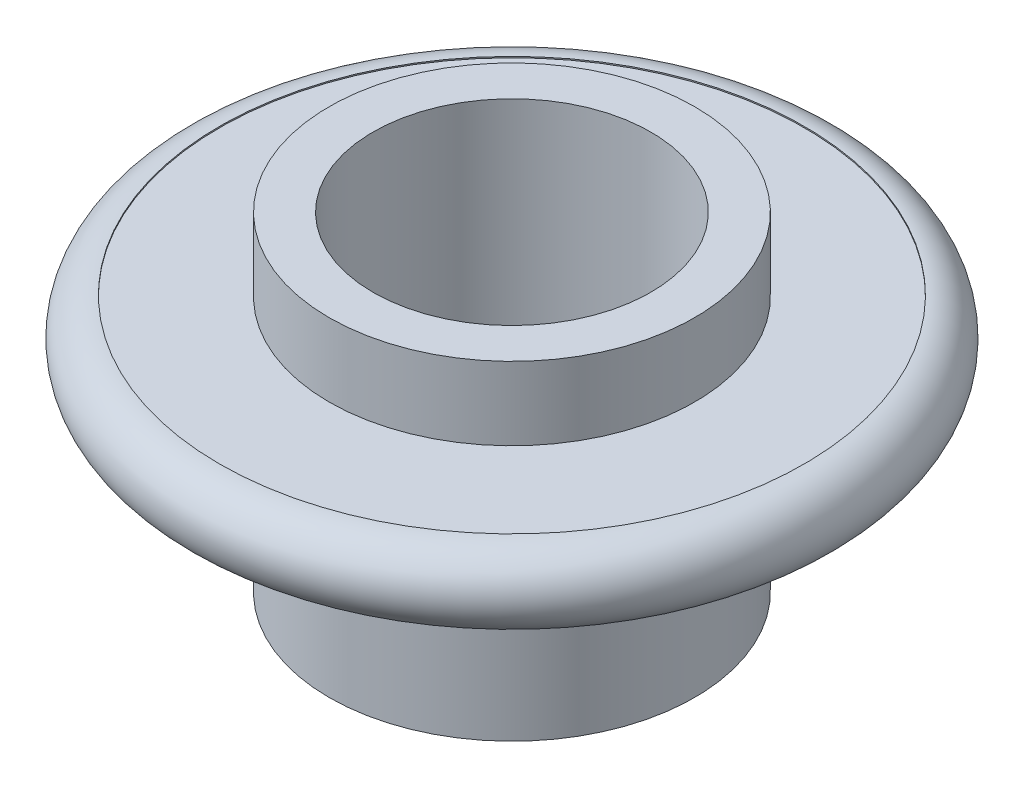
ISO-10303-21;
HEADER;
FILE_DESCRIPTION(('STEP AP214'),'2;1');
FILE_NAME('part.step','',(''),(''),'','','');
FILE_SCHEMA(('AUTOMOTIVE_DESIGN { 1 0 10303 214 1 1 1 1 }'));
ENDSEC;
DATA;
#1=APPLICATION_CONTEXT('core data for automotive mechanical design processes');
#2=APPLICATION_PROTOCOL_DEFINITION('international standard','automotive_design',2000,#1);
#3=PRODUCT_CONTEXT('',#1,'mechanical');
#4=PRODUCT('Part','Part','',(#3));
#5=PRODUCT_RELATED_PRODUCT_CATEGORY('part','',(#4));
#6=PRODUCT_DEFINITION_FORMATION('','',#4);
#7=PRODUCT_DEFINITION_CONTEXT('part definition',#1,'design');
#8=PRODUCT_DEFINITION('design','',#6,#7);
#9=PRODUCT_DEFINITION_SHAPE('','',#8);
#10=(LENGTH_UNIT() NAMED_UNIT(*) SI_UNIT(.MILLI.,.METRE.));
#11=(NAMED_UNIT(*) PLANE_ANGLE_UNIT() SI_UNIT($,.RADIAN.));
#12=(NAMED_UNIT(*) SI_UNIT($,.STERADIAN.) SOLID_ANGLE_UNIT());
#13=UNCERTAINTY_MEASURE_WITH_UNIT(LENGTH_MEASURE(1.E-05),#10,'distance_accuracy_value','');
#14=(GEOMETRIC_REPRESENTATION_CONTEXT(3) GLOBAL_UNCERTAINTY_ASSIGNED_CONTEXT((#13)) GLOBAL_UNIT_ASSIGNED_CONTEXT((#10,
#11,#12)) REPRESENTATION_CONTEXT('',''));
#15=CARTESIAN_POINT('',(0.,0.,0.));
#16=DIRECTION('',(0.,0.,1.));
#17=DIRECTION('',(1.,0.,0.));
#18=AXIS2_PLACEMENT_3D('',#15,#16,#17);
#19=CARTESIAN_POINT('',(19.,34.1894633604128,0.));
#20=DIRECTION('',(0.,-1.,0.));
#21=DIRECTION('',(0.,0.,-1.));
#22=AXIS2_PLACEMENT_3D('',#19,#20,#21);
#23=PLANE('',#22);
#24=CARTESIAN_POINT('',(0.,34.1894633604128,0.));
#25=DIRECTION('',(0.,1.,0.));
#26=DIRECTION('',(0.,0.,1.));
#27=AXIS2_PLACEMENT_3D('',#24,#25,#26);
#28=CIRCLE('',#27,19.);
#29=CARTESIAN_POINT('',(0.,34.1894633604128,19.));
#30=VERTEX_POINT('',#29);
#31=EDGE_CURVE('E10',#30,#30,#28,.T.);
#32=ORIENTED_EDGE('',*,*,#31,.F.);
#33=EDGE_LOOP('',(#32));
#34=FACE_BOUND('',#33,.T.);
#35=CARTESIAN_POINT('',(0.,34.1894633604128,0.));
#36=DIRECTION('',(0.,1.,0.));
#37=DIRECTION('',(0.,0.,1.));
#38=AXIS2_PLACEMENT_3D('',#35,#36,#37);
#39=CIRCLE('',#38,25.);
#40=CARTESIAN_POINT('',(0.,34.1894633604128,25.));
#41=VERTEX_POINT('',#40);
#42=EDGE_CURVE('E62',#41,#41,#39,.T.);
#43=ORIENTED_EDGE('',*,*,#42,.T.);
#44=EDGE_LOOP('',(#43));
#45=FACE_BOUND('',#44,.T.);
#46=ADVANCED_FACE('F31',(#34,#45),#23,.F.);
#47=CARTESIAN_POINT('',(0.,56.7977926191005,0.));
#48=DIRECTION('',(0.,1.,0.));
#49=DIRECTION('',(0.,0.,1.));
#50=AXIS2_PLACEMENT_3D('',#47,#48,#49);
#51=CYLINDRICAL_SURFACE('',#50,19.);
#52=CARTESIAN_POINT('',(0.,-10.8105366395872,0.));
#53=DIRECTION('',(0.,1.,0.));
#54=DIRECTION('',(0.,0.,1.));
#55=AXIS2_PLACEMENT_3D('',#52,#53,#54);
#56=CIRCLE('',#55,19.);
#57=CARTESIAN_POINT('',(0.,-10.8105366395872,19.));
#58=VERTEX_POINT('',#57);
#59=EDGE_CURVE('E37',#58,#58,#56,.T.);
#60=ORIENTED_EDGE('',*,*,#59,.F.);
#61=EDGE_LOOP('',(#60));
#62=FACE_BOUND('',#61,.T.);
#63=ORIENTED_EDGE('',*,*,#31,.T.);
#64=EDGE_LOOP('',(#63));
#65=FACE_BOUND('',#64,.T.);
#66=ADVANCED_FACE('F105',(#62,#65),#51,.F.);
#67=CARTESIAN_POINT('',(19.,-10.8105366395872,0.));
#68=DIRECTION('',(0.,1.,0.));
#69=DIRECTION('',(0.,0.,1.));
#70=AXIS2_PLACEMENT_3D('',#67,#68,#69);
#71=PLANE('',#70);
#72=CARTESIAN_POINT('',(0.,-10.8105366395872,0.));
#73=DIRECTION('',(0.,1.,0.));
#74=DIRECTION('',(0.,0.,1.));
#75=AXIS2_PLACEMENT_3D('',#72,#73,#74);
#76=CIRCLE('',#75,25.);
#77=CARTESIAN_POINT('',(0.,-10.8105366395872,25.));
#78=VERTEX_POINT('',#77);
#79=EDGE_CURVE('E41',#78,#78,#76,.T.);
#80=ORIENTED_EDGE('',*,*,#79,.F.);
#81=EDGE_LOOP('',(#80));
#82=FACE_BOUND('',#81,.T.);
#83=ORIENTED_EDGE('',*,*,#59,.T.);
#84=EDGE_LOOP('',(#83));
#85=FACE_BOUND('',#84,.T.);
#86=ADVANCED_FACE('F100',(#82,#85),#71,.F.);
#87=CARTESIAN_POINT('',(0.,56.7977926191005,0.));
#88=DIRECTION('',(0.,1.,0.));
#89=DIRECTION('',(0.,0.,1.));
#90=AXIS2_PLACEMENT_3D('',#87,#88,#89);
#91=CYLINDRICAL_SURFACE('',#90,25.);
#92=CARTESIAN_POINT('',(0.,14.1894633604128,0.));
#93=DIRECTION('',(0.,1.,0.));
#94=DIRECTION('',(0.,0.,1.));
#95=AXIS2_PLACEMENT_3D('',#92,#93,#94);
#96=CIRCLE('',#95,25.);
#97=CARTESIAN_POINT('',(0.,14.1894633604128,25.));
#98=VERTEX_POINT('',#97);
#99=EDGE_CURVE('E45',#98,#98,#96,.T.);
#100=ORIENTED_EDGE('',*,*,#99,.F.);
#101=EDGE_LOOP('',(#100));
#102=FACE_BOUND('',#101,.T.);
#103=ORIENTED_EDGE('',*,*,#79,.T.);
#104=EDGE_LOOP('',(#103));
#105=FACE_BOUND('',#104,.T.);
#106=ADVANCED_FACE('F94',(#102,#105),#91,.T.);
#107=CARTESIAN_POINT('',(25.,14.1894633604128,0.));
#108=DIRECTION('',(0.,1.,0.));
#109=DIRECTION('',(0.,0.,1.));
#110=AXIS2_PLACEMENT_3D('',#107,#108,#109);
#111=PLANE('',#110);
#112=CARTESIAN_POINT('',(0.,14.1894633604128,0.));
#113=DIRECTION('',(0.,1.,0.));
#114=DIRECTION('',(0.,0.,1.));
#115=AXIS2_PLACEMENT_3D('',#112,#113,#114);
#116=CIRCLE('',#115,40.);
#117=CARTESIAN_POINT('',(0.,14.1894633604128,40.));
#118=VERTEX_POINT('',#117);
#119=EDGE_CURVE('E50',#118,#118,#116,.T.);
#120=ORIENTED_EDGE('',*,*,#119,.F.);
#121=EDGE_LOOP('',(#120));
#122=FACE_BOUND('',#121,.T.);
#123=ORIENTED_EDGE('',*,*,#99,.T.);
#124=EDGE_LOOP('',(#123));
#125=FACE_BOUND('',#124,.T.);
#126=ADVANCED_FACE('F88',(#122,#125),#111,.F.);
#127=CARTESIAN_POINT('',(0.,19.2742091231247,0.));
#128=DIRECTION('',(0.,1.,0.));
#129=DIRECTION('',(0.,0.,1.));
#130=AXIS2_PLACEMENT_3D('',#127,#128,#129);
#131=TOROIDAL_SURFACE('',#130,40.,5.08474576271186);
#132=CARTESIAN_POINT('',(0.,24.3589548858365,0.));
#133=DIRECTION('',(0.,1.,0.));
#134=DIRECTION('',(0.,0.,1.));
#135=AXIS2_PLACEMENT_3D('',#132,#133,#134);
#136=CIRCLE('',#135,40.);
#137=CARTESIAN_POINT('',(0.,24.3589548858365,40.));
#138=VERTEX_POINT('',#137);
#139=EDGE_CURVE('E53',#138,#138,#136,.T.);
#140=ORIENTED_EDGE('',*,*,#139,.F.);
#141=EDGE_LOOP('',(#140));
#142=FACE_BOUND('',#141,.T.);
#143=ORIENTED_EDGE('',*,*,#119,.T.);
#144=EDGE_LOOP('',(#143));
#145=FACE_BOUND('',#144,.T.);
#146=ADVANCED_FACE('F82',(#142,#145),#131,.T.);
#147=CARTESIAN_POINT('',(0.,56.7977926191005,0.));
#148=DIRECTION('',(0.,1.,0.));
#149=DIRECTION('',(0.,0.,1.));
#150=AXIS2_PLACEMENT_3D('',#147,#148,#149);
#151=CYLINDRICAL_SURFACE('',#150,40.);
#152=CARTESIAN_POINT('',(0.,24.1894633604128,0.));
#153=DIRECTION('',(0.,1.,0.));
#154=DIRECTION('',(0.,0.,1.));
#155=AXIS2_PLACEMENT_3D('',#152,#153,#154);
#156=CIRCLE('',#155,40.);
#157=CARTESIAN_POINT('',(0.,24.1894633604128,40.));
#158=VERTEX_POINT('',#157);
#159=EDGE_CURVE('E56',#158,#158,#156,.T.);
#160=ORIENTED_EDGE('',*,*,#159,.F.);
#161=EDGE_LOOP('',(#160));
#162=FACE_BOUND('',#161,.T.);
#163=ORIENTED_EDGE('',*,*,#139,.T.);
#164=EDGE_LOOP('',(#163));
#165=FACE_BOUND('',#164,.T.);
#166=ADVANCED_FACE('F76',(#162,#165),#151,.F.);
#167=CARTESIAN_POINT('',(25.,24.1894633604128,0.));
#168=DIRECTION('',(0.,-1.,0.));
#169=DIRECTION('',(0.,0.,-1.));
#170=AXIS2_PLACEMENT_3D('',#167,#168,#169);
#171=PLANE('',#170);
#172=CARTESIAN_POINT('',(0.,24.1894633604128,0.));
#173=DIRECTION('',(0.,1.,0.));
#174=DIRECTION('',(0.,0.,1.));
#175=AXIS2_PLACEMENT_3D('',#172,#173,#174);
#176=CIRCLE('',#175,25.);
#177=CARTESIAN_POINT('',(0.,24.1894633604128,25.));
#178=VERTEX_POINT('',#177);
#179=EDGE_CURVE('E59',#178,#178,#176,.T.);
#180=ORIENTED_EDGE('',*,*,#179,.F.);
#181=EDGE_LOOP('',(#180));
#182=FACE_BOUND('',#181,.T.);
#183=ORIENTED_EDGE('',*,*,#159,.T.);
#184=EDGE_LOOP('',(#183));
#185=FACE_BOUND('',#184,.T.);
#186=ADVANCED_FACE('F70',(#182,#185),#171,.F.);
#187=CARTESIAN_POINT('',(0.,56.7977926191005,0.));
#188=DIRECTION('',(0.,1.,0.));
#189=DIRECTION('',(0.,0.,1.));
#190=AXIS2_PLACEMENT_3D('',#187,#188,#189);
#191=CYLINDRICAL_SURFACE('',#190,25.);
#192=ORIENTED_EDGE('',*,*,#42,.F.);
#193=EDGE_LOOP('',(#192));
#194=FACE_BOUND('',#193,.T.);
#195=ORIENTED_EDGE('',*,*,#179,.T.);
#196=EDGE_LOOP('',(#195));
#197=FACE_BOUND('',#196,.T.);
#198=ADVANCED_FACE('F67',(#194,#197),#191,.T.);
#199=CLOSED_SHELL('',(#46,#66,#86,#106,#126,#146,#166,#186,#198));
#200=MANIFOLD_SOLID_BREP('B2',#199);
#201=ADVANCED_BREP_SHAPE_REPRESENTATION('',(#18,#200),#14);
#202=SHAPE_DEFINITION_REPRESENTATION(#9,#201);
ENDSEC;
END-ISO-10303-21;
